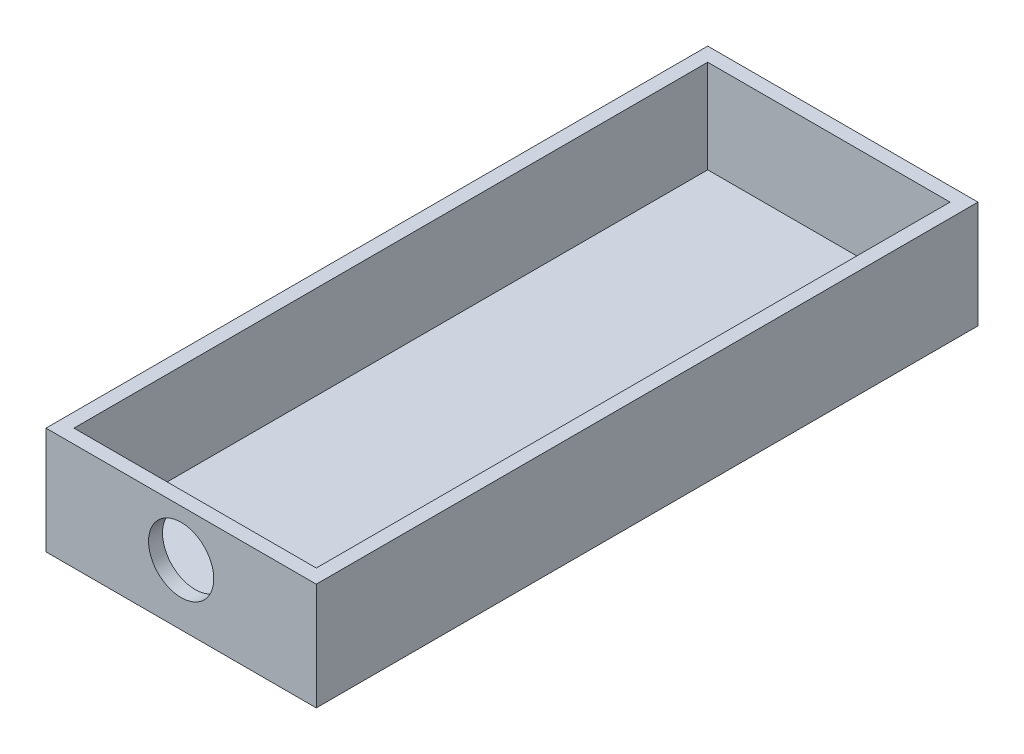
ISO-10303-21;
HEADER;
FILE_DESCRIPTION(('STEP AP214'),'2;1');
FILE_NAME('part.step','',(''),(''),'','','');
FILE_SCHEMA(('AUTOMOTIVE_DESIGN { 1 0 10303 214 1 1 1 1 }'));
ENDSEC;
DATA;
#1=APPLICATION_CONTEXT('core data for automotive mechanical design processes');
#2=APPLICATION_PROTOCOL_DEFINITION('international standard','automotive_design',2000,#1);
#3=PRODUCT_CONTEXT('',#1,'mechanical');
#4=PRODUCT('Part','Part','',(#3));
#5=PRODUCT_RELATED_PRODUCT_CATEGORY('part','',(#4));
#6=PRODUCT_DEFINITION_FORMATION('','',#4);
#7=PRODUCT_DEFINITION_CONTEXT('part definition',#1,'design');
#8=PRODUCT_DEFINITION('design','',#6,#7);
#9=PRODUCT_DEFINITION_SHAPE('','',#8);
#10=(LENGTH_UNIT() NAMED_UNIT(*) SI_UNIT(.MILLI.,.METRE.));
#11=(NAMED_UNIT(*) PLANE_ANGLE_UNIT() SI_UNIT($,.RADIAN.));
#12=(NAMED_UNIT(*) SI_UNIT($,.STERADIAN.) SOLID_ANGLE_UNIT());
#13=UNCERTAINTY_MEASURE_WITH_UNIT(LENGTH_MEASURE(1.E-05),#10,'distance_accuracy_value','');
#14=(GEOMETRIC_REPRESENTATION_CONTEXT(3) GLOBAL_UNCERTAINTY_ASSIGNED_CONTEXT((#13)) GLOBAL_UNIT_ASSIGNED_CONTEXT((#10,
#11,#12)) REPRESENTATION_CONTEXT('',''));
#15=CARTESIAN_POINT('',(0.,0.,0.));
#16=DIRECTION('',(0.,0.,1.));
#17=DIRECTION('',(1.,0.,0.));
#18=AXIS2_PLACEMENT_3D('',#15,#16,#17);
#19=CARTESIAN_POINT('',(0.,1.5,0.));
#20=DIRECTION('',(1.,0.,0.));
#21=DIRECTION('',(0.,0.,-1.));
#22=AXIS2_PLACEMENT_3D('',#19,#20,#21);
#23=PLANE('',#22);
#24=DIRECTION('',(0.,0.,1.));
#25=VECTOR('',#24,1.);
#26=CARTESIAN_POINT('',(0.,0.,0.));
#27=LINE('',#26,#25);
#28=CARTESIAN_POINT('',(0.,0.,-71.));
#29=VERTEX_POINT('',#28);
#30=CARTESIAN_POINT('',(0.,0.,0.));
#31=VERTEX_POINT('',#30);
#32=EDGE_CURVE('E175',#29,#31,#27,.T.);
#33=ORIENTED_EDGE('',*,*,#32,.T.);
#34=DIRECTION('',(0.,-1.,0.));
#35=VECTOR('',#34,1.);
#36=CARTESIAN_POINT('',(0.,1.5,0.));
#37=LINE('',#36,#35);
#38=CARTESIAN_POINT('',(0.,11.5,0.));
#39=VERTEX_POINT('',#38);
#40=EDGE_CURVE('E11',#39,#31,#37,.T.);
#41=ORIENTED_EDGE('',*,*,#40,.F.);
#42=DIRECTION('',(0.,0.,1.));
#43=VECTOR('',#42,1.);
#44=CARTESIAN_POINT('',(0.,11.5,-71.));
#45=LINE('',#44,#43);
#46=CARTESIAN_POINT('',(0.,11.5,-71.));
#47=VERTEX_POINT('',#46);
#48=EDGE_CURVE('E163',#47,#39,#45,.T.);
#49=ORIENTED_EDGE('',*,*,#48,.F.);
#50=DIRECTION('',(0.,-1.,0.));
#51=VECTOR('',#50,1.);
#52=CARTESIAN_POINT('',(0.,1.5,-71.));
#53=LINE('',#52,#51);
#54=EDGE_CURVE('E187',#47,#29,#53,.T.);
#55=ORIENTED_EDGE('',*,*,#54,.T.);
#56=EDGE_LOOP('',(#33,#41,#49,#55));
#57=FACE_BOUND('',#56,.T.);
#58=ADVANCED_FACE('F39',(#57),#23,.F.);
#59=CARTESIAN_POINT('',(0.,1.5,0.));
#60=DIRECTION('',(0.,0.,-1.));
#61=DIRECTION('',(-1.,0.,0.));
#62=AXIS2_PLACEMENT_3D('',#59,#60,#61);
#63=PLANE('',#62);
#64=CARTESIAN_POINT('',(14.5,6.5,0.));
#65=DIRECTION('',(0.,0.,-1.));
#66=DIRECTION('',(-1.,0.,0.));
#67=AXIS2_PLACEMENT_3D('',#64,#65,#66);
#68=CIRCLE('',#67,3.5);
#69=CARTESIAN_POINT('',(11.,6.5,0.));
#70=VERTEX_POINT('',#69);
#71=EDGE_CURVE('E143',#70,#70,#68,.T.);
#72=ORIENTED_EDGE('',*,*,#71,.T.);
#73=EDGE_LOOP('',(#72));
#74=FACE_BOUND('',#73,.T.);
#75=DIRECTION('',(1.,0.,0.));
#76=VECTOR('',#75,1.);
#77=CARTESIAN_POINT('',(0.,0.,0.));
#78=LINE('',#77,#76);
#79=CARTESIAN_POINT('',(29.,0.,0.));
#80=VERTEX_POINT('',#79);
#81=EDGE_CURVE('E179',#31,#80,#78,.T.);
#82=ORIENTED_EDGE('',*,*,#81,.T.);
#83=DIRECTION('',(0.,-1.,0.));
#84=VECTOR('',#83,1.);
#85=CARTESIAN_POINT('',(29.,1.5,0.));
#86=LINE('',#85,#84);
#87=CARTESIAN_POINT('',(29.,11.5,0.));
#88=VERTEX_POINT('',#87);
#89=EDGE_CURVE('E47',#88,#80,#86,.T.);
#90=ORIENTED_EDGE('',*,*,#89,.F.);
#91=DIRECTION('',(1.,0.,0.));
#92=VECTOR('',#91,1.);
#93=CARTESIAN_POINT('',(0.,11.5,0.));
#94=LINE('',#93,#92);
#95=EDGE_CURVE('E167',#39,#88,#94,.T.);
#96=ORIENTED_EDGE('',*,*,#95,.F.);
#97=ORIENTED_EDGE('',*,*,#40,.T.);
#98=EDGE_LOOP('',(#82,#90,#96,#97));
#99=FACE_BOUND('',#98,.T.);
#100=ADVANCED_FACE('F208',(#74,#99),#63,.F.);
#101=CARTESIAN_POINT('',(29.,1.5,0.));
#102=DIRECTION('',(-1.,0.,0.));
#103=DIRECTION('',(0.,0.,1.));
#104=AXIS2_PLACEMENT_3D('',#101,#102,#103);
#105=PLANE('',#104);
#106=DIRECTION('',(0.,0.,-1.));
#107=VECTOR('',#106,1.);
#108=CARTESIAN_POINT('',(29.,0.,0.));
#109=LINE('',#108,#107);
#110=CARTESIAN_POINT('',(29.,0.,-71.));
#111=VERTEX_POINT('',#110);
#112=EDGE_CURVE('E182',#80,#111,#109,.T.);
#113=ORIENTED_EDGE('',*,*,#112,.T.);
#114=DIRECTION('',(0.,-1.,0.));
#115=VECTOR('',#114,1.);
#116=CARTESIAN_POINT('',(29.,1.5,-71.));
#117=LINE('',#116,#115);
#118=CARTESIAN_POINT('',(29.,11.5,-71.));
#119=VERTEX_POINT('',#118);
#120=EDGE_CURVE('E190',#119,#111,#117,.T.);
#121=ORIENTED_EDGE('',*,*,#120,.F.);
#122=DIRECTION('',(0.,0.,-1.));
#123=VECTOR('',#122,1.);
#124=CARTESIAN_POINT('',(29.,11.5,0.));
#125=LINE('',#124,#123);
#126=EDGE_CURVE('E171',#88,#119,#125,.T.);
#127=ORIENTED_EDGE('',*,*,#126,.F.);
#128=ORIENTED_EDGE('',*,*,#89,.T.);
#129=EDGE_LOOP('',(#113,#121,#127,#128));
#130=FACE_BOUND('',#129,.T.);
#131=ADVANCED_FACE('F197',(#130),#105,.F.);
#132=CARTESIAN_POINT('',(0.,1.5,-71.));
#133=DIRECTION('',(0.,0.,1.));
#134=DIRECTION('',(1.,0.,0.));
#135=AXIS2_PLACEMENT_3D('',#132,#133,#134);
#136=PLANE('',#135);
#137=DIRECTION('',(-1.,0.,0.));
#138=VECTOR('',#137,1.);
#139=CARTESIAN_POINT('',(0.,0.,-71.));
#140=LINE('',#139,#138);
#141=EDGE_CURVE('E62',#111,#29,#140,.T.);
#142=ORIENTED_EDGE('',*,*,#141,.T.);
#143=ORIENTED_EDGE('',*,*,#54,.F.);
#144=DIRECTION('',(-1.,0.,0.));
#145=VECTOR('',#144,1.);
#146=CARTESIAN_POINT('',(29.,11.5,-71.));
#147=LINE('',#146,#145);
#148=EDGE_CURVE('E124',#119,#47,#147,.T.);
#149=ORIENTED_EDGE('',*,*,#148,.F.);
#150=ORIENTED_EDGE('',*,*,#120,.T.);
#151=EDGE_LOOP('',(#142,#143,#149,#150));
#152=FACE_BOUND('',#151,.T.);
#153=ADVANCED_FACE('F206',(#152),#136,.F.);
#154=CARTESIAN_POINT('',(0.,0.,0.));
#155=DIRECTION('',(0.,-1.,0.));
#156=DIRECTION('',(0.,0.,-1.));
#157=AXIS2_PLACEMENT_3D('',#154,#155,#156);
#158=PLANE('',#157);
#159=ORIENTED_EDGE('',*,*,#32,.F.);
#160=ORIENTED_EDGE('',*,*,#141,.F.);
#161=ORIENTED_EDGE('',*,*,#112,.F.);
#162=ORIENTED_EDGE('',*,*,#81,.F.);
#163=EDGE_LOOP('',(#159,#160,#161,#162));
#164=FACE_BOUND('',#163,.T.);
#165=ADVANCED_FACE('F202',(#164),#158,.T.);
#166=CARTESIAN_POINT('',(0.,11.5,0.));
#167=DIRECTION('',(0.,1.,0.));
#168=DIRECTION('',(0.,0.,1.));
#169=AXIS2_PLACEMENT_3D('',#166,#167,#168);
#170=PLANE('',#169);
#171=ORIENTED_EDGE('',*,*,#148,.T.);
#172=ORIENTED_EDGE('',*,*,#48,.T.);
#173=ORIENTED_EDGE('',*,*,#95,.T.);
#174=ORIENTED_EDGE('',*,*,#126,.T.);
#175=EDGE_LOOP('',(#171,#172,#173,#174));
#176=FACE_BOUND('',#175,.T.);
#177=DIRECTION('',(0.,0.,1.));
#178=VECTOR('',#177,1.);
#179=CARTESIAN_POINT('',(1.5,11.5,-69.5));
#180=LINE('',#179,#178);
#181=CARTESIAN_POINT('',(1.5,11.5,-69.5));
#182=VERTEX_POINT('',#181);
#183=CARTESIAN_POINT('',(1.5,11.5,-1.5));
#184=VERTEX_POINT('',#183);
#185=EDGE_CURVE('E115',#182,#184,#180,.T.);
#186=ORIENTED_EDGE('',*,*,#185,.F.);
#187=DIRECTION('',(-1.,0.,0.));
#188=VECTOR('',#187,1.);
#189=CARTESIAN_POINT('',(27.5,11.5,-69.5));
#190=LINE('',#189,#188);
#191=CARTESIAN_POINT('',(27.5,11.5,-69.5));
#192=VERTEX_POINT('',#191);
#193=EDGE_CURVE('E106',#192,#182,#190,.T.);
#194=ORIENTED_EDGE('',*,*,#193,.F.);
#195=DIRECTION('',(0.,0.,-1.));
#196=VECTOR('',#195,1.);
#197=CARTESIAN_POINT('',(27.5,11.5,-1.5));
#198=LINE('',#197,#196);
#199=CARTESIAN_POINT('',(27.5,11.5,-1.5));
#200=VERTEX_POINT('',#199);
#201=EDGE_CURVE('E134',#200,#192,#198,.T.);
#202=ORIENTED_EDGE('',*,*,#201,.F.);
#203=DIRECTION('',(1.,0.,0.));
#204=VECTOR('',#203,1.);
#205=CARTESIAN_POINT('',(1.5,11.5,-1.5));
#206=LINE('',#205,#204);
#207=EDGE_CURVE('E130',#184,#200,#206,.T.);
#208=ORIENTED_EDGE('',*,*,#207,.F.);
#209=EDGE_LOOP('',(#186,#194,#202,#208));
#210=FACE_BOUND('',#209,.T.);
#211=ADVANCED_FACE('F128',(#176,#210),#170,.T.);
#212=CARTESIAN_POINT('',(27.5,11.5,-69.5));
#213=DIRECTION('',(0.,0.,1.));
#214=DIRECTION('',(1.,0.,0.));
#215=AXIS2_PLACEMENT_3D('',#212,#213,#214);
#216=PLANE('',#215);
#217=DIRECTION('',(-1.,0.,0.));
#218=VECTOR('',#217,1.);
#219=CARTESIAN_POINT('',(27.5,1.5,-69.5));
#220=LINE('',#219,#218);
#221=CARTESIAN_POINT('',(27.5,1.5,-69.5));
#222=VERTEX_POINT('',#221);
#223=CARTESIAN_POINT('',(1.5,1.5,-69.5));
#224=VERTEX_POINT('',#223);
#225=EDGE_CURVE('E140',#222,#224,#220,.T.);
#226=ORIENTED_EDGE('',*,*,#225,.F.);
#227=DIRECTION('',(0.,-1.,0.));
#228=VECTOR('',#227,1.);
#229=CARTESIAN_POINT('',(27.5,11.5,-69.5));
#230=LINE('',#229,#228);
#231=EDGE_CURVE('E54',#192,#222,#230,.T.);
#232=ORIENTED_EDGE('',*,*,#231,.F.);
#233=ORIENTED_EDGE('',*,*,#193,.T.);
#234=DIRECTION('',(0.,-1.,0.));
#235=VECTOR('',#234,1.);
#236=CARTESIAN_POINT('',(1.5,11.5,-69.5));
#237=LINE('',#236,#235);
#238=EDGE_CURVE('E109',#182,#224,#237,.T.);
#239=ORIENTED_EDGE('',*,*,#238,.T.);
#240=EDGE_LOOP('',(#226,#232,#233,#239));
#241=FACE_BOUND('',#240,.T.);
#242=ADVANCED_FACE('F108',(#241),#216,.T.);
#243=CARTESIAN_POINT('',(1.5,11.5,-69.5));
#244=DIRECTION('',(1.,0.,0.));
#245=DIRECTION('',(0.,0.,-1.));
#246=AXIS2_PLACEMENT_3D('',#243,#244,#245);
#247=PLANE('',#246);
#248=DIRECTION('',(0.,0.,1.));
#249=VECTOR('',#248,1.);
#250=CARTESIAN_POINT('',(1.5,1.5,-69.5));
#251=LINE('',#250,#249);
#252=CARTESIAN_POINT('',(1.5,1.5,-1.5));
#253=VERTEX_POINT('',#252);
#254=EDGE_CURVE('E122',#224,#253,#251,.T.);
#255=ORIENTED_EDGE('',*,*,#254,.F.);
#256=ORIENTED_EDGE('',*,*,#238,.F.);
#257=ORIENTED_EDGE('',*,*,#185,.T.);
#258=DIRECTION('',(0.,-1.,0.));
#259=VECTOR('',#258,1.);
#260=CARTESIAN_POINT('',(1.5,11.5,-1.5));
#261=LINE('',#260,#259);
#262=EDGE_CURVE('E125',#184,#253,#261,.T.);
#263=ORIENTED_EDGE('',*,*,#262,.T.);
#264=EDGE_LOOP('',(#255,#256,#257,#263));
#265=FACE_BOUND('',#264,.T.);
#266=ADVANCED_FACE('F119',(#265),#247,.T.);
#267=CARTESIAN_POINT('',(1.5,11.5,-1.5));
#268=DIRECTION('',(0.,0.,-1.));
#269=DIRECTION('',(-1.,0.,0.));
#270=AXIS2_PLACEMENT_3D('',#267,#268,#269);
#271=PLANE('',#270);
#272=CARTESIAN_POINT('',(14.5,6.5,-1.5));
#273=DIRECTION('',(0.,0.,-1.));
#274=DIRECTION('',(-1.,0.,0.));
#275=AXIS2_PLACEMENT_3D('',#272,#273,#274);
#276=CIRCLE('',#275,3.5);
#277=CARTESIAN_POINT('',(11.,6.5,-1.5));
#278=VERTEX_POINT('',#277);
#279=EDGE_CURVE('E247',#278,#278,#276,.T.);
#280=ORIENTED_EDGE('',*,*,#279,.F.);
#281=EDGE_LOOP('',(#280));
#282=FACE_BOUND('',#281,.T.);
#283=DIRECTION('',(1.,0.,0.));
#284=VECTOR('',#283,1.);
#285=CARTESIAN_POINT('',(1.5,1.5,-1.5));
#286=LINE('',#285,#284);
#287=CARTESIAN_POINT('',(27.5,1.5,-1.5));
#288=VERTEX_POINT('',#287);
#289=EDGE_CURVE('E146',#253,#288,#286,.T.);
#290=ORIENTED_EDGE('',*,*,#289,.F.);
#291=ORIENTED_EDGE('',*,*,#262,.F.);
#292=ORIENTED_EDGE('',*,*,#207,.T.);
#293=DIRECTION('',(0.,-1.,0.));
#294=VECTOR('',#293,1.);
#295=CARTESIAN_POINT('',(27.5,11.5,-1.5));
#296=LINE('',#295,#294);
#297=EDGE_CURVE('E155',#200,#288,#296,.T.);
#298=ORIENTED_EDGE('',*,*,#297,.T.);
#299=EDGE_LOOP('',(#290,#291,#292,#298));
#300=FACE_BOUND('',#299,.T.);
#301=ADVANCED_FACE('F234',(#282,#300),#271,.T.);
#302=CARTESIAN_POINT('',(27.5,11.5,-1.5));
#303=DIRECTION('',(-1.,0.,0.));
#304=DIRECTION('',(0.,0.,1.));
#305=AXIS2_PLACEMENT_3D('',#302,#303,#304);
#306=PLANE('',#305);
#307=DIRECTION('',(0.,0.,-1.));
#308=VECTOR('',#307,1.);
#309=CARTESIAN_POINT('',(27.5,1.5,-1.5));
#310=LINE('',#309,#308);
#311=EDGE_CURVE('E116',#288,#222,#310,.T.);
#312=ORIENTED_EDGE('',*,*,#311,.F.);
#313=ORIENTED_EDGE('',*,*,#297,.F.);
#314=ORIENTED_EDGE('',*,*,#201,.T.);
#315=ORIENTED_EDGE('',*,*,#231,.T.);
#316=EDGE_LOOP('',(#312,#313,#314,#315));
#317=FACE_BOUND('',#316,.T.);
#318=ADVANCED_FACE('F226',(#317),#306,.T.);
#319=CARTESIAN_POINT('',(0.,1.5,0.));
#320=DIRECTION('',(0.,-1.,0.));
#321=DIRECTION('',(0.,0.,-1.));
#322=AXIS2_PLACEMENT_3D('',#319,#320,#321);
#323=PLANE('',#322);
#324=ORIENTED_EDGE('',*,*,#311,.T.);
#325=ORIENTED_EDGE('',*,*,#225,.T.);
#326=ORIENTED_EDGE('',*,*,#254,.T.);
#327=ORIENTED_EDGE('',*,*,#289,.T.);
#328=EDGE_LOOP('',(#324,#325,#326,#327));
#329=FACE_BOUND('',#328,.T.);
#330=ADVANCED_FACE('F222',(#329),#323,.F.);
#331=CARTESIAN_POINT('',(14.5,6.5,7.5));
#332=DIRECTION('',(0.,0.,-1.));
#333=DIRECTION('',(-1.,0.,0.));
#334=AXIS2_PLACEMENT_3D('',#331,#332,#333);
#335=CYLINDRICAL_SURFACE('',#334,3.5);
#336=ORIENTED_EDGE('',*,*,#279,.T.);
#337=EDGE_LOOP('',(#336));
#338=FACE_BOUND('',#337,.T.);
#339=ORIENTED_EDGE('',*,*,#71,.F.);
#340=EDGE_LOOP('',(#339));
#341=FACE_BOUND('',#340,.T.);
#342=ADVANCED_FACE('F225',(#338,#341),#335,.F.);
#343=CLOSED_SHELL('',(#58,#100,#131,#153,#165,#211,#242,#266,#301,#318,#330,#342));
#344=MANIFOLD_SOLID_BREP('B2',#343);
#345=ADVANCED_BREP_SHAPE_REPRESENTATION('',(#18,#344),#14);
#346=SHAPE_DEFINITION_REPRESENTATION(#9,#345);
ENDSEC;
END-ISO-10303-21;
